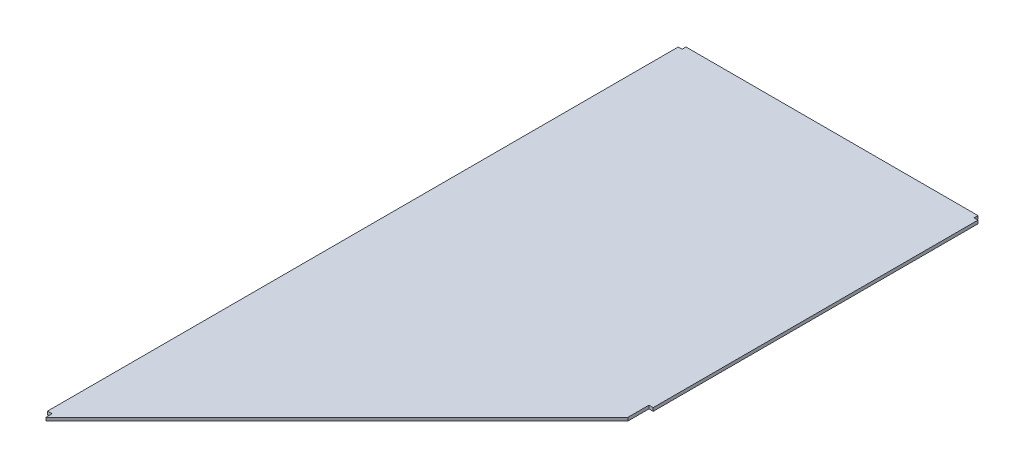
ISO-10303-21;
HEADER;
FILE_DESCRIPTION(('STEP AP214'),'2;1');
FILE_NAME('part.step','',(''),(''),'','','');
FILE_SCHEMA(('AUTOMOTIVE_DESIGN { 1 0 10303 214 1 1 1 1 }'));
ENDSEC;
DATA;
#1=APPLICATION_CONTEXT('core data for automotive mechanical design processes');
#2=APPLICATION_PROTOCOL_DEFINITION('international standard','automotive_design',2000,#1);
#3=PRODUCT_CONTEXT('',#1,'mechanical');
#4=PRODUCT('Part','Part','',(#3));
#5=PRODUCT_RELATED_PRODUCT_CATEGORY('part','',(#4));
#6=PRODUCT_DEFINITION_FORMATION('','',#4);
#7=PRODUCT_DEFINITION_CONTEXT('part definition',#1,'design');
#8=PRODUCT_DEFINITION('design','',#6,#7);
#9=PRODUCT_DEFINITION_SHAPE('','',#8);
#10=(LENGTH_UNIT() NAMED_UNIT(*) SI_UNIT(.MILLI.,.METRE.));
#11=(NAMED_UNIT(*) PLANE_ANGLE_UNIT() SI_UNIT($,.RADIAN.));
#12=(NAMED_UNIT(*) SI_UNIT($,.STERADIAN.) SOLID_ANGLE_UNIT());
#13=UNCERTAINTY_MEASURE_WITH_UNIT(LENGTH_MEASURE(1.E-05),#10,'distance_accuracy_value','');
#14=(GEOMETRIC_REPRESENTATION_CONTEXT(3) GLOBAL_UNCERTAINTY_ASSIGNED_CONTEXT((#13)) GLOBAL_UNIT_ASSIGNED_CONTEXT((#10,
#11,#12)) REPRESENTATION_CONTEXT('',''));
#15=CARTESIAN_POINT('',(0.,0.,0.));
#16=DIRECTION('',(0.,0.,1.));
#17=DIRECTION('',(1.,0.,0.));
#18=AXIS2_PLACEMENT_3D('',#15,#16,#17);
#19=CARTESIAN_POINT('',(230.,0.,495.));
#20=DIRECTION('',(0.,1.,0.));
#21=DIRECTION('',(1.,0.,0.));
#22=AXIS2_PLACEMENT_3D('',#19,#20,#21);
#23=PLANE('',#22);
#24=DIRECTION('',(-1.,0.,0.));
#25=VECTOR('',#24,1.);
#26=CARTESIAN_POINT('',(7.,0.,973.5));
#27=LINE('',#26,#25);
#28=CARTESIAN_POINT('',(7.,0.,973.5));
#29=VERTEX_POINT('',#28);
#30=CARTESIAN_POINT('',(0.,0.,973.5));
#31=VERTEX_POINT('',#30);
#32=EDGE_CURVE('E11',#29,#31,#27,.T.);
#33=ORIENTED_EDGE('',*,*,#32,.T.);
#34=DIRECTION('',(0.,0.,1.));
#35=VECTOR('',#34,1.);
#36=CARTESIAN_POINT('',(0.,0.,0.));
#37=LINE('',#36,#35);
#38=CARTESIAN_POINT('',(0.,0.,6.));
#39=VERTEX_POINT('',#38);
#40=EDGE_CURVE('E24',#39,#31,#37,.T.);
#41=ORIENTED_EDGE('',*,*,#40,.F.);
#42=DIRECTION('',(-1.,0.,0.));
#43=VECTOR('',#42,1.);
#44=CARTESIAN_POINT('',(6.,0.,6.));
#45=LINE('',#44,#43);
#46=CARTESIAN_POINT('',(6.,0.,6.));
#47=VERTEX_POINT('',#46);
#48=EDGE_CURVE('E208',#47,#39,#45,.T.);
#49=ORIENTED_EDGE('',*,*,#48,.F.);
#50=DIRECTION('',(0.,0.,1.));
#51=VECTOR('',#50,1.);
#52=CARTESIAN_POINT('',(6.,0.,0.));
#53=LINE('',#52,#51);
#54=CARTESIAN_POINT('',(6.,0.,0.));
#55=VERTEX_POINT('',#54);
#56=EDGE_CURVE('E203',#55,#47,#53,.T.);
#57=ORIENTED_EDGE('',*,*,#56,.F.);
#58=DIRECTION('',(1.,0.,0.));
#59=VECTOR('',#58,1.);
#60=CARTESIAN_POINT('',(0.,0.,0.));
#61=LINE('',#60,#59);
#62=CARTESIAN_POINT('',(454.,0.,0.));
#63=VERTEX_POINT('',#62);
#64=EDGE_CURVE('E199',#55,#63,#61,.T.);
#65=ORIENTED_EDGE('',*,*,#64,.T.);
#66=DIRECTION('',(0.,0.,1.));
#67=VECTOR('',#66,1.);
#68=CARTESIAN_POINT('',(454.,0.,0.));
#69=LINE('',#68,#67);
#70=CARTESIAN_POINT('',(454.,0.,6.));
#71=VERTEX_POINT('',#70);
#72=EDGE_CURVE('E197',#63,#71,#69,.T.);
#73=ORIENTED_EDGE('',*,*,#72,.T.);
#74=DIRECTION('',(1.,0.,0.));
#75=VECTOR('',#74,1.);
#76=CARTESIAN_POINT('',(230.,0.,6.));
#77=LINE('',#76,#75);
#78=CARTESIAN_POINT('',(460.,0.,6.));
#79=VERTEX_POINT('',#78);
#80=EDGE_CURVE('E193',#71,#79,#77,.T.);
#81=ORIENTED_EDGE('',*,*,#80,.T.);
#82=DIRECTION('',(0.,0.,1.));
#83=VECTOR('',#82,1.);
#84=CARTESIAN_POINT('',(460.,0.,0.));
#85=LINE('',#84,#83);
#86=CARTESIAN_POINT('',(460.,0.,504.395266744439));
#87=VERTEX_POINT('',#86);
#88=EDGE_CURVE('E189',#79,#87,#85,.T.);
#89=ORIENTED_EDGE('',*,*,#88,.T.);
#90=DIRECTION('',(-1.,0.,0.));
#91=VECTOR('',#90,1.);
#92=CARTESIAN_POINT('',(460.000293504121,0.,504.395266744439));
#93=LINE('',#92,#91);
#94=CARTESIAN_POINT('',(453.500098930069,0.,504.395266744439));
#95=VERTEX_POINT('',#94);
#96=EDGE_CURVE('E185',#87,#95,#93,.T.);
#97=ORIENTED_EDGE('',*,*,#96,.T.);
#98=DIRECTION('',(0.,0.,1.));
#99=VECTOR('',#98,1.);
#100=CARTESIAN_POINT('',(453.500098930069,0.,504.395266744439));
#101=LINE('',#100,#99);
#102=CARTESIAN_POINT('',(453.500098930069,0.,536.499901069931));
#103=VERTEX_POINT('',#102);
#104=EDGE_CURVE('E181',#95,#103,#101,.T.);
#105=ORIENTED_EDGE('',*,*,#104,.T.);
#106=DIRECTION('',(0.707106781186547,0.,-0.707106781186548));
#107=VECTOR('',#106,1.);
#108=CARTESIAN_POINT('',(0.,0.,990.));
#109=LINE('',#108,#107);
#110=CARTESIAN_POINT('',(7.,0.,983.));
#111=VERTEX_POINT('',#110);
#112=EDGE_CURVE('E176',#111,#103,#109,.T.);
#113=ORIENTED_EDGE('',*,*,#112,.F.);
#114=DIRECTION('',(0.,0.,-1.));
#115=VECTOR('',#114,1.);
#116=CARTESIAN_POINT('',(7.,0.,990.));
#117=LINE('',#116,#115);
#118=EDGE_CURVE('E118',#111,#29,#117,.T.);
#119=ORIENTED_EDGE('',*,*,#118,.T.);
#120=EDGE_LOOP('',(#33,#41,#49,#57,#65,#73,#81,#89,#97,#105,#113,#119));
#121=FACE_BOUND('',#120,.T.);
#122=ADVANCED_FACE('F16',(#121),#23,.F.);
#123=CARTESIAN_POINT('',(230.,5.,495.));
#124=DIRECTION('',(0.,1.,0.));
#125=DIRECTION('',(0.,0.,1.));
#126=AXIS2_PLACEMENT_3D('',#123,#124,#125);
#127=PLANE('',#126);
#128=DIRECTION('',(1.,0.,0.));
#129=VECTOR('',#128,1.);
#130=CARTESIAN_POINT('',(7.,5.,973.5));
#131=LINE('',#130,#129);
#132=CARTESIAN_POINT('',(0.,5.,973.5));
#133=VERTEX_POINT('',#132);
#134=CARTESIAN_POINT('',(7.,5.,973.5));
#135=VERTEX_POINT('',#134);
#136=EDGE_CURVE('E103',#133,#135,#131,.T.);
#137=ORIENTED_EDGE('',*,*,#136,.T.);
#138=DIRECTION('',(0.,0.,1.));
#139=VECTOR('',#138,1.);
#140=CARTESIAN_POINT('',(7.,5.,990.));
#141=LINE('',#140,#139);
#142=CARTESIAN_POINT('',(7.,5.,983.));
#143=VERTEX_POINT('',#142);
#144=EDGE_CURVE('E119',#135,#143,#141,.T.);
#145=ORIENTED_EDGE('',*,*,#144,.T.);
#146=DIRECTION('',(0.707106781186547,0.,-0.707106781186548));
#147=VECTOR('',#146,1.);
#148=CARTESIAN_POINT('',(0.,5.,990.));
#149=LINE('',#148,#147);
#150=CARTESIAN_POINT('',(453.500098930069,5.,536.499901069931));
#151=VERTEX_POINT('',#150);
#152=EDGE_CURVE('E164',#143,#151,#149,.T.);
#153=ORIENTED_EDGE('',*,*,#152,.T.);
#154=DIRECTION('',(0.,0.,-1.));
#155=VECTOR('',#154,1.);
#156=CARTESIAN_POINT('',(453.500098930069,5.,504.395266744439));
#157=LINE('',#156,#155);
#158=CARTESIAN_POINT('',(453.500098930069,5.,504.395266744439));
#159=VERTEX_POINT('',#158);
#160=EDGE_CURVE('E160',#151,#159,#157,.T.);
#161=ORIENTED_EDGE('',*,*,#160,.T.);
#162=DIRECTION('',(1.,0.,0.));
#163=VECTOR('',#162,1.);
#164=CARTESIAN_POINT('',(460.000293504121,5.,504.395266744439));
#165=LINE('',#164,#163);
#166=CARTESIAN_POINT('',(460.,5.,504.395266744439));
#167=VERTEX_POINT('',#166);
#168=EDGE_CURVE('E156',#159,#167,#165,.T.);
#169=ORIENTED_EDGE('',*,*,#168,.T.);
#170=DIRECTION('',(0.,0.,-1.));
#171=VECTOR('',#170,1.);
#172=CARTESIAN_POINT('',(460.,5.,0.));
#173=LINE('',#172,#171);
#174=CARTESIAN_POINT('',(460.,5.,6.));
#175=VERTEX_POINT('',#174);
#176=EDGE_CURVE('E154',#167,#175,#173,.T.);
#177=ORIENTED_EDGE('',*,*,#176,.T.);
#178=DIRECTION('',(-1.,0.,0.));
#179=VECTOR('',#178,1.);
#180=CARTESIAN_POINT('',(230.,5.,6.));
#181=LINE('',#180,#179);
#182=CARTESIAN_POINT('',(454.,5.,6.));
#183=VERTEX_POINT('',#182);
#184=EDGE_CURVE('E150',#175,#183,#181,.T.);
#185=ORIENTED_EDGE('',*,*,#184,.T.);
#186=DIRECTION('',(0.,0.,-1.));
#187=VECTOR('',#186,1.);
#188=CARTESIAN_POINT('',(454.,5.,0.));
#189=LINE('',#188,#187);
#190=CARTESIAN_POINT('',(454.,5.,0.));
#191=VERTEX_POINT('',#190);
#192=EDGE_CURVE('E146',#183,#191,#189,.T.);
#193=ORIENTED_EDGE('',*,*,#192,.T.);
#194=DIRECTION('',(-1.,0.,0.));
#195=VECTOR('',#194,1.);
#196=CARTESIAN_POINT('',(0.,5.,0.));
#197=LINE('',#196,#195);
#198=CARTESIAN_POINT('',(6.,5.,0.));
#199=VERTEX_POINT('',#198);
#200=EDGE_CURVE('E142',#191,#199,#197,.T.);
#201=ORIENTED_EDGE('',*,*,#200,.T.);
#202=DIRECTION('',(0.,0.,1.));
#203=VECTOR('',#202,1.);
#204=CARTESIAN_POINT('',(6.,5.,0.));
#205=LINE('',#204,#203);
#206=CARTESIAN_POINT('',(6.,5.,6.));
#207=VERTEX_POINT('',#206);
#208=EDGE_CURVE('E138',#199,#207,#205,.T.);
#209=ORIENTED_EDGE('',*,*,#208,.T.);
#210=DIRECTION('',(-1.,0.,0.));
#211=VECTOR('',#210,1.);
#212=CARTESIAN_POINT('',(6.,5.,6.));
#213=LINE('',#212,#211);
#214=CARTESIAN_POINT('',(0.,5.,6.));
#215=VERTEX_POINT('',#214);
#216=EDGE_CURVE('E106',#207,#215,#213,.T.);
#217=ORIENTED_EDGE('',*,*,#216,.T.);
#218=DIRECTION('',(0.,0.,1.));
#219=VECTOR('',#218,1.);
#220=CARTESIAN_POINT('',(0.,5.,0.));
#221=LINE('',#220,#219);
#222=EDGE_CURVE('E100',#215,#133,#221,.T.);
#223=ORIENTED_EDGE('',*,*,#222,.T.);
#224=EDGE_LOOP('',(#137,#145,#153,#161,#169,#177,#185,#193,#201,#209,#217,#223));
#225=FACE_BOUND('',#224,.T.);
#226=ADVANCED_FACE('F102',(#225),#127,.T.);
#227=CARTESIAN_POINT('',(0.,0.,973.5));
#228=DIRECTION('',(0.,0.,1.));
#229=DIRECTION('',(1.,0.,0.));
#230=AXIS2_PLACEMENT_3D('',#227,#228,#229);
#231=PLANE('',#230);
#232=ORIENTED_EDGE('',*,*,#32,.F.);
#233=DIRECTION('',(0.,1.,0.));
#234=VECTOR('',#233,1.);
#235=CARTESIAN_POINT('',(7.,0.,973.5));
#236=LINE('',#235,#234);
#237=EDGE_CURVE('E111',#29,#135,#236,.T.);
#238=ORIENTED_EDGE('',*,*,#237,.T.);
#239=ORIENTED_EDGE('',*,*,#136,.F.);
#240=DIRECTION('',(0.,1.,0.));
#241=VECTOR('',#240,1.);
#242=CARTESIAN_POINT('',(0.,0.,973.5));
#243=LINE('',#242,#241);
#244=EDGE_CURVE('E115',#31,#133,#243,.T.);
#245=ORIENTED_EDGE('',*,*,#244,.F.);
#246=EDGE_LOOP('',(#232,#238,#239,#245));
#247=FACE_BOUND('',#246,.T.);
#248=ADVANCED_FACE('F114',(#247),#231,.T.);
#249=CARTESIAN_POINT('',(7.,0.,973.5));
#250=DIRECTION('',(-1.,0.,0.));
#251=DIRECTION('',(0.,0.,1.));
#252=AXIS2_PLACEMENT_3D('',#249,#250,#251);
#253=PLANE('',#252);
#254=ORIENTED_EDGE('',*,*,#118,.F.);
#255=DIRECTION('',(0.,1.,0.));
#256=VECTOR('',#255,1.);
#257=CARTESIAN_POINT('',(7.,0.,983.));
#258=LINE('',#257,#256);
#259=EDGE_CURVE('E122',#111,#143,#258,.T.);
#260=ORIENTED_EDGE('',*,*,#259,.T.);
#261=ORIENTED_EDGE('',*,*,#144,.F.);
#262=ORIENTED_EDGE('',*,*,#237,.F.);
#263=EDGE_LOOP('',(#254,#260,#261,#262));
#264=FACE_BOUND('',#263,.T.);
#265=ADVANCED_FACE('F271',(#264),#253,.T.);
#266=CARTESIAN_POINT('',(7.,0.,983.));
#267=DIRECTION('',(0.707106781186548,0.,0.707106781186547));
#268=DIRECTION('',(0.707106781186547,0.,-0.707106781186548));
#269=AXIS2_PLACEMENT_3D('',#266,#267,#268);
#270=PLANE('',#269);
#271=ORIENTED_EDGE('',*,*,#112,.T.);
#272=DIRECTION('',(0.,1.,0.));
#273=VECTOR('',#272,1.);
#274=CARTESIAN_POINT('',(453.500098930069,0.,536.499901069931));
#275=LINE('',#274,#273);
#276=EDGE_CURVE('E126',#103,#151,#275,.T.);
#277=ORIENTED_EDGE('',*,*,#276,.T.);
#278=ORIENTED_EDGE('',*,*,#152,.F.);
#279=ORIENTED_EDGE('',*,*,#259,.F.);
#280=EDGE_LOOP('',(#271,#277,#278,#279));
#281=FACE_BOUND('',#280,.T.);
#282=ADVANCED_FACE('F262',(#281),#270,.T.);
#283=CARTESIAN_POINT('',(453.500098930069,0.,536.499901069931));
#284=DIRECTION('',(1.,0.,0.));
#285=DIRECTION('',(0.,0.,-1.));
#286=AXIS2_PLACEMENT_3D('',#283,#284,#285);
#287=PLANE('',#286);
#288=ORIENTED_EDGE('',*,*,#104,.F.);
#289=DIRECTION('',(0.,1.,0.));
#290=VECTOR('',#289,1.);
#291=CARTESIAN_POINT('',(453.500098930069,0.,504.395266744439));
#292=LINE('',#291,#290);
#293=EDGE_CURVE('E248',#95,#159,#292,.T.);
#294=ORIENTED_EDGE('',*,*,#293,.T.);
#295=ORIENTED_EDGE('',*,*,#160,.F.);
#296=ORIENTED_EDGE('',*,*,#276,.F.);
#297=EDGE_LOOP('',(#288,#294,#295,#296));
#298=FACE_BOUND('',#297,.T.);
#299=ADVANCED_FACE('F266',(#298),#287,.T.);
#300=CARTESIAN_POINT('',(453.500098930069,0.,504.395266744439));
#301=DIRECTION('',(0.,0.,1.));
#302=DIRECTION('',(1.,0.,0.));
#303=AXIS2_PLACEMENT_3D('',#300,#301,#302);
#304=PLANE('',#303);
#305=ORIENTED_EDGE('',*,*,#96,.F.);
#306=DIRECTION('',(0.,1.,0.));
#307=VECTOR('',#306,1.);
#308=CARTESIAN_POINT('',(460.,0.,504.395266744439));
#309=LINE('',#308,#307);
#310=EDGE_CURVE('E245',#87,#167,#309,.T.);
#311=ORIENTED_EDGE('',*,*,#310,.T.);
#312=ORIENTED_EDGE('',*,*,#168,.F.);
#313=ORIENTED_EDGE('',*,*,#293,.F.);
#314=EDGE_LOOP('',(#305,#311,#312,#313));
#315=FACE_BOUND('',#314,.T.);
#316=ADVANCED_FACE('F274',(#315),#304,.T.);
#317=CARTESIAN_POINT('',(460.,0.,504.395266744439));
#318=DIRECTION('',(1.,0.,0.));
#319=DIRECTION('',(0.,0.,-1.));
#320=AXIS2_PLACEMENT_3D('',#317,#318,#319);
#321=PLANE('',#320);
#322=ORIENTED_EDGE('',*,*,#88,.F.);
#323=DIRECTION('',(0.,1.,0.));
#324=VECTOR('',#323,1.);
#325=CARTESIAN_POINT('',(460.,0.,6.));
#326=LINE('',#325,#324);
#327=EDGE_CURVE('E242',#79,#175,#326,.T.);
#328=ORIENTED_EDGE('',*,*,#327,.T.);
#329=ORIENTED_EDGE('',*,*,#176,.F.);
#330=ORIENTED_EDGE('',*,*,#310,.F.);
#331=EDGE_LOOP('',(#322,#328,#329,#330));
#332=FACE_BOUND('',#331,.T.);
#333=ADVANCED_FACE('F279',(#332),#321,.T.);
#334=CARTESIAN_POINT('',(6.,0.,6.));
#335=DIRECTION('',(0.,0.,-1.));
#336=DIRECTION('',(-1.,0.,0.));
#337=AXIS2_PLACEMENT_3D('',#334,#335,#336);
#338=PLANE('',#337);
#339=ORIENTED_EDGE('',*,*,#80,.F.);
#340=DIRECTION('',(0.,1.,0.));
#341=VECTOR('',#340,1.);
#342=CARTESIAN_POINT('',(454.,0.,6.));
#343=LINE('',#342,#341);
#344=EDGE_CURVE('E237',#71,#183,#343,.T.);
#345=ORIENTED_EDGE('',*,*,#344,.T.);
#346=ORIENTED_EDGE('',*,*,#184,.F.);
#347=ORIENTED_EDGE('',*,*,#327,.F.);
#348=EDGE_LOOP('',(#339,#345,#346,#347));
#349=FACE_BOUND('',#348,.T.);
#350=ADVANCED_FACE('F286',(#349),#338,.T.);
#351=CARTESIAN_POINT('',(454.,0.,6.));
#352=DIRECTION('',(1.,0.,0.));
#353=DIRECTION('',(0.,0.,-1.));
#354=AXIS2_PLACEMENT_3D('',#351,#352,#353);
#355=PLANE('',#354);
#356=ORIENTED_EDGE('',*,*,#72,.F.);
#357=DIRECTION('',(0.,1.,0.));
#358=VECTOR('',#357,1.);
#359=CARTESIAN_POINT('',(454.,0.,0.));
#360=LINE('',#359,#358);
#361=EDGE_CURVE('E232',#63,#191,#360,.T.);
#362=ORIENTED_EDGE('',*,*,#361,.T.);
#363=ORIENTED_EDGE('',*,*,#192,.F.);
#364=ORIENTED_EDGE('',*,*,#344,.F.);
#365=EDGE_LOOP('',(#356,#362,#363,#364));
#366=FACE_BOUND('',#365,.T.);
#367=ADVANCED_FACE('F289',(#366),#355,.T.);
#368=CARTESIAN_POINT('',(454.,0.,0.));
#369=DIRECTION('',(0.,0.,-1.));
#370=DIRECTION('',(-1.,0.,0.));
#371=AXIS2_PLACEMENT_3D('',#368,#369,#370);
#372=PLANE('',#371);
#373=ORIENTED_EDGE('',*,*,#64,.F.);
#374=DIRECTION('',(0.,1.,0.));
#375=VECTOR('',#374,1.);
#376=CARTESIAN_POINT('',(6.,0.,0.));
#377=LINE('',#376,#375);
#378=EDGE_CURVE('E223',#55,#199,#377,.T.);
#379=ORIENTED_EDGE('',*,*,#378,.T.);
#380=ORIENTED_EDGE('',*,*,#200,.F.);
#381=ORIENTED_EDGE('',*,*,#361,.F.);
#382=EDGE_LOOP('',(#373,#379,#380,#381));
#383=FACE_BOUND('',#382,.T.);
#384=ADVANCED_FACE('F294',(#383),#372,.T.);
#385=CARTESIAN_POINT('',(6.,0.,0.));
#386=DIRECTION('',(-1.,0.,0.));
#387=DIRECTION('',(0.,0.,1.));
#388=AXIS2_PLACEMENT_3D('',#385,#386,#387);
#389=PLANE('',#388);
#390=ORIENTED_EDGE('',*,*,#56,.T.);
#391=DIRECTION('',(0.,1.,0.));
#392=VECTOR('',#391,1.);
#393=CARTESIAN_POINT('',(6.,0.,6.));
#394=LINE('',#393,#392);
#395=EDGE_CURVE('E221',#47,#207,#394,.T.);
#396=ORIENTED_EDGE('',*,*,#395,.T.);
#397=ORIENTED_EDGE('',*,*,#208,.F.);
#398=ORIENTED_EDGE('',*,*,#378,.F.);
#399=EDGE_LOOP('',(#390,#396,#397,#398));
#400=FACE_BOUND('',#399,.T.);
#401=ADVANCED_FACE('F298',(#400),#389,.T.);
#402=ORIENTED_EDGE('',*,*,#48,.T.);
#403=DIRECTION('',(0.,1.,0.));
#404=VECTOR('',#403,1.);
#405=CARTESIAN_POINT('',(0.,0.,6.));
#406=LINE('',#405,#404);
#407=EDGE_CURVE('E219',#39,#215,#406,.T.);
#408=ORIENTED_EDGE('',*,*,#407,.T.);
#409=ORIENTED_EDGE('',*,*,#216,.F.);
#410=ORIENTED_EDGE('',*,*,#395,.F.);
#411=EDGE_LOOP('',(#402,#408,#409,#410));
#412=FACE_BOUND('',#411,.T.);
#413=ADVANCED_FACE('F218',(#412),#338,.T.);
#414=CARTESIAN_POINT('',(0.,0.,6.));
#415=DIRECTION('',(-1.,0.,0.));
#416=DIRECTION('',(0.,0.,1.));
#417=AXIS2_PLACEMENT_3D('',#414,#415,#416);
#418=PLANE('',#417);
#419=ORIENTED_EDGE('',*,*,#40,.T.);
#420=ORIENTED_EDGE('',*,*,#244,.T.);
#421=ORIENTED_EDGE('',*,*,#222,.F.);
#422=ORIENTED_EDGE('',*,*,#407,.F.);
#423=EDGE_LOOP('',(#419,#420,#421,#422));
#424=FACE_BOUND('',#423,.T.);
#425=ADVANCED_FACE('F121',(#424),#418,.T.);
#426=CLOSED_SHELL('',(#122,#226,#248,#265,#282,#299,#316,#333,#350,#367,#384,#401,#413,#425));
#427=MANIFOLD_SOLID_BREP('B1',#426);
#428=ADVANCED_BREP_SHAPE_REPRESENTATION('',(#18,#427),#14);
#429=SHAPE_DEFINITION_REPRESENTATION(#9,#428);
ENDSEC;
END-ISO-10303-21;
